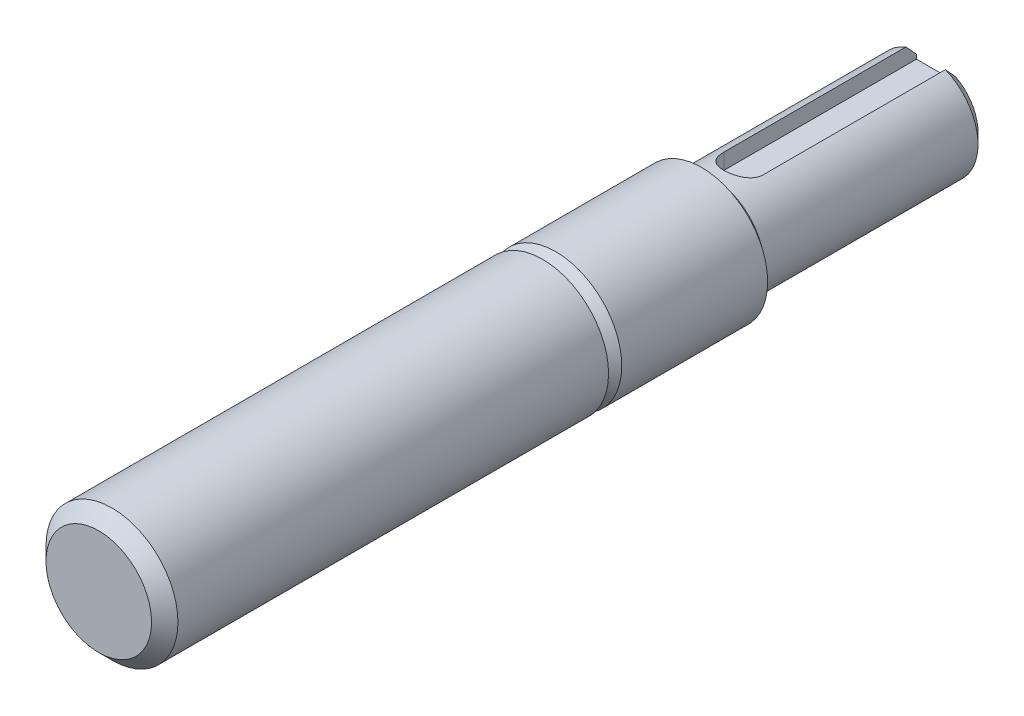
ISO-10303-21;
HEADER;
FILE_DESCRIPTION(('STEP AP214'),'2;1');
FILE_NAME('part.step','',(''),(''),'','','');
FILE_SCHEMA(('AUTOMOTIVE_DESIGN { 1 0 10303 214 1 1 1 1 }'));
ENDSEC;
DATA;
#1=APPLICATION_CONTEXT('core data for automotive mechanical design processes');
#2=APPLICATION_PROTOCOL_DEFINITION('international standard','automotive_design',2000,#1);
#3=PRODUCT_CONTEXT('',#1,'mechanical');
#4=PRODUCT('Part','Part','',(#3));
#5=PRODUCT_RELATED_PRODUCT_CATEGORY('part','',(#4));
#6=PRODUCT_DEFINITION_FORMATION('','',#4);
#7=PRODUCT_DEFINITION_CONTEXT('part definition',#1,'design');
#8=PRODUCT_DEFINITION('design','',#6,#7);
#9=PRODUCT_DEFINITION_SHAPE('','',#8);
#10=(LENGTH_UNIT() NAMED_UNIT(*) SI_UNIT(.MILLI.,.METRE.));
#11=(NAMED_UNIT(*) PLANE_ANGLE_UNIT() SI_UNIT($,.RADIAN.));
#12=(NAMED_UNIT(*) SI_UNIT($,.STERADIAN.) SOLID_ANGLE_UNIT());
#13=UNCERTAINTY_MEASURE_WITH_UNIT(LENGTH_MEASURE(1.E-05),#10,'distance_accuracy_value','');
#14=(GEOMETRIC_REPRESENTATION_CONTEXT(3) GLOBAL_UNCERTAINTY_ASSIGNED_CONTEXT((#13)) GLOBAL_UNIT_ASSIGNED_CONTEXT((#10,
#11,#12)) REPRESENTATION_CONTEXT('',''));
#15=CARTESIAN_POINT('',(0.,0.,0.));
#16=DIRECTION('',(0.,0.,1.));
#17=DIRECTION('',(1.,0.,0.));
#18=AXIS2_PLACEMENT_3D('',#15,#16,#17);
#19=CARTESIAN_POINT('',(0.,1.98120000000001,-39.1159999999999));
#20=DIRECTION('',(0.,1.00000000000001,0.));
#21=DIRECTION('',(0.,0.,1.00000000000001));
#22=AXIS2_PLACEMENT_3D('',#19,#20,#21);
#23=PLANE('',#22);
#24=CARTESIAN_POINT('',(0.,1.98120000000001,-39.1159999999999));
#25=DIRECTION('',(0.,1.00000000000001,0.));
#26=DIRECTION('',(0.,0.,1.00000000000001));
#27=AXIS2_PLACEMENT_3D('',#24,#25,#26);
#28=CIRCLE('',#27,1.19380000000001);
#29=CARTESIAN_POINT('',(-1.19380000000003,1.98120000000001,-39.1159999999999));
#30=VERTEX_POINT('',#29);
#31=CARTESIAN_POINT('',(1.19380000000002,1.98120000000001,-39.1159999999999));
#32=VERTEX_POINT('',#31);
#33=EDGE_CURVE('E82',#30,#32,#28,.T.);
#34=ORIENTED_EDGE('',*,*,#33,.T.);
#35=DIRECTION('',(0.,0.,-1.00000000000001));
#36=VECTOR('',#35,1.);
#37=CARTESIAN_POINT('',(1.19380000000002,1.98120000000001,-39.1159999999999));
#38=LINE('',#37,#36);
#39=CARTESIAN_POINT('',(1.19380000000002,1.98120000000001,-50.8));
#40=VERTEX_POINT('',#39);
#41=EDGE_CURVE('E78',#32,#40,#38,.T.);
#42=ORIENTED_EDGE('',*,*,#41,.T.);
#43=DIRECTION('',(1.00000000000001,0.,0.));
#44=VECTOR('',#43,1.);
#45=CARTESIAN_POINT('',(0.,1.98120000000001,-50.8));
#46=LINE('',#45,#44);
#47=CARTESIAN_POINT('',(-1.19380000000003,1.98120000000001,-50.8));
#48=VERTEX_POINT('',#47);
#49=EDGE_CURVE('E80',#40,#48,#46,.F.);
#50=ORIENTED_EDGE('',*,*,#49,.T.);
#51=DIRECTION('',(0.,0.,1.00000000000001));
#52=VECTOR('',#51,1.);
#53=CARTESIAN_POINT('',(-1.19380000000003,1.98120000000001,-50.8));
#54=LINE('',#53,#52);
#55=EDGE_CURVE('E105',#48,#30,#54,.T.);
#56=ORIENTED_EDGE('',*,*,#55,.T.);
#57=EDGE_LOOP('',(#34,#42,#50,#56));
#58=FACE_BOUND('',#57,.T.);
#59=ADVANCED_FACE('F24',(#58),#23,.T.);
#60=CARTESIAN_POINT('',(0.,2.54000000000001,-50.8));
#61=DIRECTION('',(0.,0.,1.00000000000001));
#62=DIRECTION('',(1.00000000000001,0.,0.));
#63=AXIS2_PLACEMENT_3D('',#60,#61,#62);
#64=PLANE('',#63);
#65=DIRECTION('',(0.,1.00000000000001,0.));
#66=VECTOR('',#65,1.);
#67=CARTESIAN_POINT('',(1.19380000000002,1.98120000000001,-50.8));
#68=LINE('',#67,#66);
#69=CARTESIAN_POINT('',(1.19380000000002,2.241972693858,-50.7999999999906));
#70=VERTEX_POINT('',#69);
#71=EDGE_CURVE('E87',#40,#70,#68,.T.);
#72=ORIENTED_EDGE('',*,*,#71,.T.);
#73=CARTESIAN_POINT('',(0.,0.,-50.7999999999811));
#74=DIRECTION('',(0.,0.,1.00000000000001));
#75=DIRECTION('',(0.,-1.00000000000001,0.));
#76=AXIS2_PLACEMENT_3D('',#73,#74,#75);
#77=CIRCLE('',#76,2.54000000001042);
#78=CARTESIAN_POINT('',(-1.19380000000003,2.24197269386216,-50.7999999999869));
#79=VERTEX_POINT('',#78);
#80=EDGE_CURVE('E72',#79,#70,#77,.T.);
#81=ORIENTED_EDGE('',*,*,#80,.F.);
#82=DIRECTION('',(0.,1.00000000000001,0.));
#83=VECTOR('',#82,1.);
#84=CARTESIAN_POINT('',(-1.19380000000003,1.98120000000001,-50.8));
#85=LINE('',#84,#83);
#86=EDGE_CURVE('E93',#79,#48,#85,.F.);
#87=ORIENTED_EDGE('',*,*,#86,.T.);
#88=ORIENTED_EDGE('',*,*,#49,.F.);
#89=EDGE_LOOP('',(#72,#81,#87,#88));
#90=FACE_BOUND('',#89,.T.);
#91=ADVANCED_FACE('F90',(#90),#64,.F.);
#92=CARTESIAN_POINT('',(1.19380000000002,1.98120000000001,-39.1159999999999));
#93=DIRECTION('',(1.00000000000001,0.,0.));
#94=DIRECTION('',(0.,0.,-1.00000000000001));
#95=AXIS2_PLACEMENT_3D('',#92,#93,#94);
#96=PLANE('',#95);
#97=ORIENTED_EDGE('',*,*,#71,.F.);
#98=ORIENTED_EDGE('',*,*,#41,.F.);
#99=DIRECTION('',(0.,1.00000000000001,0.));
#100=VECTOR('',#99,1.);
#101=CARTESIAN_POINT('',(1.19380000000002,1.98120000000001,-39.1159999999999));
#102=LINE('',#101,#100);
#103=CARTESIAN_POINT('',(1.19380000000001,2.9420174302679,-39.1159999999999));
#104=VERTEX_POINT('',#103);
#105=EDGE_CURVE('E99',#32,#104,#102,.T.);
#106=ORIENTED_EDGE('',*,*,#105,.T.);
#107=DIRECTION('',(0.,0.,1.00000000000001));
#108=VECTOR('',#107,1.);
#109=CARTESIAN_POINT('',(1.1938,2.94201743026791,0.));
#110=LINE('',#109,#108);
#111=CARTESIAN_POINT('',(1.19380000000001,2.9420174302658,-50.1649999999978));
#112=VERTEX_POINT('',#111);
#113=EDGE_CURVE('E138',#112,#104,#110,.T.);
#114=ORIENTED_EDGE('',*,*,#113,.F.);
#115=CARTESIAN_POINT('',(1.19380000000002,2.2419726938556,-50.7999999999926));
#116=CARTESIAN_POINT('',(1.19380000000002,2.30102184773773,-50.7478727474391));
#117=CARTESIAN_POINT('',(1.19380000000002,2.35985132104961,-50.69549787316));
#118=CARTESIAN_POINT('',(1.19380000000002,2.47713422347976,-50.5903327827947));
#119=CARTESIAN_POINT('',(1.19380000000002,2.53558766595212,-50.5375425816077));
#120=CARTESIAN_POINT('',(1.19380000000002,2.65218538347848,-50.4316235937607));
#121=CARTESIAN_POINT('',(1.19380000000002,2.71032966196328,-50.3784948108723));
#122=CARTESIAN_POINT('',(1.19380000000002,2.82635784116009,-50.2719494622468));
#123=CARTESIAN_POINT('',(1.19380000000002,2.88424173252969,-50.2185328863327));
#124=CARTESIAN_POINT('',(1.19380000000002,2.94201743026369,-50.1649999999954));
#125=B_SPLINE_CURVE_WITH_KNOTS('',3,(#115,#116,#117,#118,#119,#120,#121,#122,#123,#124),
.UNSPECIFIED.,.F.,.F.,(4,2,2,2,4),(0.,0.236295571088815,0.472582703695575,0.708867208729286,
0.94516012485222),.UNSPECIFIED.);
#126=EDGE_CURVE('E27',#70,#112,#125,.T.);
#127=ORIENTED_EDGE('',*,*,#126,.F.);
#128=EDGE_LOOP('',(#97,#98,#106,#114,#127));
#129=FACE_BOUND('',#128,.T.);
#130=ADVANCED_FACE('F96',(#129),#96,.F.);
#131=CARTESIAN_POINT('',(0.,1.98120000000001,-39.1159999999999));
#132=DIRECTION('',(0.,1.00000000000001,0.));
#133=DIRECTION('',(0.,0.,1.00000000000001));
#134=AXIS2_PLACEMENT_3D('',#131,#132,#133);
#135=CYLINDRICAL_SURFACE('',#134,1.19380000000001);
#136=ORIENTED_EDGE('',*,*,#33,.F.);
#137=DIRECTION('',(0.,1.00000000000001,0.));
#138=VECTOR('',#137,1.);
#139=CARTESIAN_POINT('',(-1.19380000000003,1.98120000000001,-39.1159999999999));
#140=LINE('',#139,#138);
#141=CARTESIAN_POINT('',(-1.19380000000003,2.9420174302679,-39.1159999999999));
#142=VERTEX_POINT('',#141);
#143=EDGE_CURVE('E47',#30,#142,#140,.T.);
#144=ORIENTED_EDGE('',*,*,#143,.T.);
#145=CARTESIAN_POINT('',(1.19380000000002,2.9420174302679,-39.1159999999999));
#146=CARTESIAN_POINT('',(1.19380119866681,2.94201358886018,-39.0837006794339));
#147=CARTESIAN_POINT('',(1.19248832274411,2.94255000472484,-39.0514181860547));
#148=CARTESIAN_POINT('',(1.18726004777156,2.94466476095056,-38.9871097153263));
#149=CARTESIAN_POINT('',(1.18334552701423,2.9462427496845,-38.955083655099));
#150=CARTESIAN_POINT('',(1.16778270495956,2.95246335059753,-38.8599733658816));
#151=CARTESIAN_POINT('',(1.15231460697321,2.95859328345994,-38.7975669873184));
#152=CARTESIAN_POINT('',(1.11178752058579,2.9740571839648,-38.6764915213747));
#153=CARTESIAN_POINT('',(1.08673654710451,2.98338847338761,-38.6178193584763));
#154=CARTESIAN_POINT('',(1.02781996154746,3.00419457553497,-38.50544959503));
#155=CARTESIAN_POINT('',(0.993947310826072,3.01567109782598,-38.4517560133961));
#156=CARTESIAN_POINT('',(0.916556207241795,3.04010954434603,-38.3482459870198));
#157=CARTESIAN_POINT('',(0.872671556205444,3.05311512160911,-38.2987137068106));
#158=CARTESIAN_POINT('',(0.77726876797622,3.07878482333537,-38.2075022142624));
#159=CARTESIAN_POINT('',(0.725747937264904,3.09144882544372,-38.1658257847588));
#160=CARTESIAN_POINT('',(0.614351502605501,3.11553409970197,-38.0901245060353));
#161=CARTESIAN_POINT('',(0.554248365904604,3.12689715223568,-38.0564145947421));
#162=CARTESIAN_POINT('',(0.428755311996347,3.14655515237974,-37.9997321113863));
#163=CARTESIAN_POINT('',(0.363372090039058,3.15485391337645,-37.9767461843049));
#164=CARTESIAN_POINT('',(0.248113919559836,3.16566292006338,-37.9472046793582));
#165=CARTESIAN_POINT('',(0.199029981495512,3.1691437195283,-37.9378494767225));
#166=CARTESIAN_POINT('',(0.0999697368556592,3.17381293873971,-37.9253464096885));
#167=CARTESIAN_POINT('',(0.0499935098316348,3.17500156182402,-37.9221979946887));
#168=CARTESIAN_POINT('',(-0.0645836126415552,3.17499798237341,-37.9222025905411));
#169=CARTESIAN_POINT('',(-0.129196067703964,3.17300972415623,-37.9274627613587));
#170=CARTESIAN_POINT('',(-0.256527554722546,3.16526427616921,-37.9483006085164));
#171=CARTESIAN_POINT('',(-0.319245052887496,3.15950411459597,-37.9638864203257));
#172=CARTESIAN_POINT('',(-0.440872116174826,3.14483739738045,-38.0047409480994));
#173=CARTESIAN_POINT('',(-0.49979020110219,3.13593819310398,-38.0299870521122));
#174=CARTESIAN_POINT('',(-0.612540299690514,3.11587921133502,-38.0893476602134));
#175=CARTESIAN_POINT('',(-0.666371662363203,3.10471914507508,-38.1234632973163));
#176=CARTESIAN_POINT('',(-0.769730700845361,3.08075692073996,-38.2011170498579));
#177=CARTESIAN_POINT('',(-0.819012913251011,3.06790808599839,-38.2449673466599));
#178=CARTESIAN_POINT('',(-0.909725244508935,3.04224448099812,-38.3401877476378));
#179=CARTESIAN_POINT('',(-0.951152407159744,3.0294297253467,-38.3915606700695));
#180=CARTESIAN_POINT('',(-1.02655136130083,3.00473884965425,-38.5027816716129));
#181=CARTESIAN_POINT('',(-1.06017236896751,2.99291828643935,-38.5628808896545));
#182=CARTESIAN_POINT('',(-1.11669659174172,2.97229264990148,-38.6883666895999));
#183=CARTESIAN_POINT('',(-1.13961269630881,2.96348395352319,-38.7537468010456));
#184=CARTESIAN_POINT('',(-1.16897915366354,2.95199794769411,-38.8688091509099));
#185=CARTESIAN_POINT('',(-1.17825632196959,2.94829017043031,-38.9176833288506));
#186=CARTESIAN_POINT('',(-1.19067896582104,2.94328394485072,-39.0163579822044));
#187=CARTESIAN_POINT('',(-1.193820132702,2.94198718957128,-39.0661590837432));
#188=CARTESIAN_POINT('',(-1.19380000000002,2.9420174302679,-39.1159999999999));
#189=B_SPLINE_CURVE_WITH_KNOTS('',3,(#145,#146,#147,#148,#149,#150,#151,#152,#153,#154,#155,
#156,#157,#158,#159,#160,#161,#162,#163,#164,#165,#166,#167,#168,#169,#170,#171,#172,#173,#174,
#175,#176,#177,#178,#179,#180,#181,#182,#183,#184,#185,#186,#187,#188),.UNSPECIFIED.,.F.,.F.,(4,
2,2,2,2,2,2,2,2,2,2,2,2,2,2,2,2,2,2,2,2,4),(0.,0.0968341725825814,0.19363567138997,
0.38638032511346,0.57896412240181,0.77170205185567,0.973134503540011,1.17463817656639,
1.38311961181788,1.59134071893424,1.74118814916198,1.89102228588725,2.08458400778526,
2.27829841668477,2.47156214275156,2.66485056890994,2.86558014013228,3.06638510544826,
3.27496528909716,3.48329367597683,3.63252530028038,3.78186167654538),.UNSPECIFIED.);
#190=EDGE_CURVE('E129',#104,#142,#189,.T.);
#191=ORIENTED_EDGE('',*,*,#190,.F.);
#192=ORIENTED_EDGE('',*,*,#105,.F.);
#193=EDGE_LOOP('',(#136,#144,#191,#192));
#194=FACE_BOUND('',#193,.T.);
#195=ADVANCED_FACE('F140',(#194),#135,.F.);
#196=CARTESIAN_POINT('',(-1.19380000000003,1.98120000000001,-50.8));
#197=DIRECTION('',(-1.00000000000001,0.,0.));
#198=DIRECTION('',(0.,0.,1.00000000000001));
#199=AXIS2_PLACEMENT_3D('',#196,#197,#198);
#200=PLANE('',#199);
#201=ORIENTED_EDGE('',*,*,#55,.F.);
#202=ORIENTED_EDGE('',*,*,#86,.F.);
#203=CARTESIAN_POINT('',(-1.19380000000003,2.94201743026369,-50.1649999999954));
#204=CARTESIAN_POINT('',(-1.19380000000003,2.88424173252969,-50.2185328863327));
#205=CARTESIAN_POINT('',(-1.19380000000003,2.82635784116009,-50.2719494622468));
#206=CARTESIAN_POINT('',(-1.19380000000003,2.71032966196328,-50.3784948108723));
#207=CARTESIAN_POINT('',(-1.19380000000003,2.65218538347849,-50.4316235937607));
#208=CARTESIAN_POINT('',(-1.19380000000003,2.53558766595213,-50.5375425816077));
#209=CARTESIAN_POINT('',(-1.19380000000003,2.47713422347976,-50.5903327827946));
#210=CARTESIAN_POINT('',(-1.19380000000003,2.35985132104962,-50.69549787316));
#211=CARTESIAN_POINT('',(-1.19380000000003,2.30102184773774,-50.7478727474391));
#212=CARTESIAN_POINT('',(-1.19380000000003,2.24197269385563,-50.7999999999926));
#213=B_SPLINE_CURVE_WITH_KNOTS('',3,(#203,#204,#205,#206,#207,#208,#209,#210,#211,#212),
.UNSPECIFIED.,.F.,.F.,(4,2,2,2,4),(0.,0.236292916122929,0.472577421156638,0.708864553763398,
0.945160124852205),.UNSPECIFIED.);
#214=CARTESIAN_POINT('',(-1.19380000000003,2.9420174302658,-50.1649999999978));
#215=VERTEX_POINT('',#214);
#216=EDGE_CURVE('E156',#215,#79,#213,.T.);
#217=ORIENTED_EDGE('',*,*,#216,.F.);
#218=DIRECTION('',(0.,0.,1.00000000000001));
#219=VECTOR('',#218,1.);
#220=CARTESIAN_POINT('',(-1.19380000000003,2.9420174302679,0.));
#221=LINE('',#220,#219);
#222=EDGE_CURVE('E137',#142,#215,#221,.F.);
#223=ORIENTED_EDGE('',*,*,#222,.F.);
#224=ORIENTED_EDGE('',*,*,#143,.F.);
#225=EDGE_LOOP('',(#201,#202,#217,#223,#224));
#226=FACE_BOUND('',#225,.T.);
#227=ADVANCED_FACE('F153',(#226),#200,.F.);
#228=CARTESIAN_POINT('',(0.,0.,-50.1649999999927));
#229=DIRECTION('',(0.,0.,1.00000000000001));
#230=DIRECTION('',(0.,-1.00000000000001,0.));
#231=AXIS2_PLACEMENT_3D('',#228,#229,#230);
#232=CONICAL_SURFACE('',#231,3.17499999999882,0.785398163397448);
#233=ORIENTED_EDGE('',*,*,#80,.T.);
#234=ORIENTED_EDGE('',*,*,#126,.T.);
#235=CARTESIAN_POINT('',(0.,0.,-50.165));
#236=DIRECTION('',(0.,0.,1.00000000000001));
#237=DIRECTION('',(1.00000000000001,0.,0.));
#238=AXIS2_PLACEMENT_3D('',#235,#236,#237);
#239=CIRCLE('',#238,3.175);
#240=EDGE_CURVE('E163',#215,#112,#239,.T.);
#241=ORIENTED_EDGE('',*,*,#240,.F.);
#242=ORIENTED_EDGE('',*,*,#216,.T.);
#243=EDGE_LOOP('',(#233,#234,#241,#242));
#244=FACE_BOUND('',#243,.T.);
#245=ADVANCED_FACE('F148',(#244),#232,.T.);
#246=CARTESIAN_POINT('',(0.,0.,0.));
#247=DIRECTION('',(0.,0.,1.00000000000001));
#248=DIRECTION('',(1.00000000000001,0.,0.));
#249=AXIS2_PLACEMENT_3D('',#246,#247,#248);
#250=CYLINDRICAL_SURFACE('',#249,3.175);
#251=ORIENTED_EDGE('',*,*,#222,.T.);
#252=ORIENTED_EDGE('',*,*,#240,.T.);
#253=ORIENTED_EDGE('',*,*,#113,.T.);
#254=ORIENTED_EDGE('',*,*,#190,.T.);
#255=EDGE_LOOP('',(#251,#252,#253,#254));
#256=FACE_BOUND('',#255,.T.);
#257=CARTESIAN_POINT('',(0.,0.,-37.2109999999566));
#258=DIRECTION('',(0.,0.,-1.00000000000001));
#259=DIRECTION('',(-1.00000000000001,0.,0.));
#260=AXIS2_PLACEMENT_3D('',#257,#258,#259);
#261=CIRCLE('',#260,3.1749999999704);
#262=CARTESIAN_POINT('',(-3.17499999997044,0.,-37.2109999999566));
#263=VERTEX_POINT('',#262);
#264=EDGE_CURVE('E128',#263,#263,#261,.F.);
#265=ORIENTED_EDGE('',*,*,#264,.F.);
#266=EDGE_LOOP('',(#265));
#267=FACE_BOUND('',#266,.T.);
#268=ADVANCED_FACE('F143',(#256,#267),#250,.T.);
#269=CARTESIAN_POINT('',(0.,0.,-37.2109999999566));
#270=DIRECTION('',(0.,0.,-1.00000000000001));
#271=DIRECTION('',(-1.00000000000001,0.,0.));
#272=AXIS2_PLACEMENT_3D('',#269,#270,#271);
#273=CONICAL_SURFACE('',#272,3.1749999999704,0.463647609000806);
#274=CARTESIAN_POINT('',(0.,0.,-36.5759999999682));
#275=DIRECTION('',(0.,0.,-1.00000000000001));
#276=DIRECTION('',(-1.00000000000001,0.,0.));
#277=AXIS2_PLACEMENT_3D('',#274,#275,#276);
#278=CIRCLE('',#277,2.8574999999762);
#279=CARTESIAN_POINT('',(-2.85749999997624,0.,-36.5759999999682));
#280=VERTEX_POINT('',#279);
#281=EDGE_CURVE('E125',#280,#280,#278,.T.);
#282=ORIENTED_EDGE('',*,*,#281,.T.);
#283=EDGE_LOOP('',(#282));
#284=FACE_BOUND('',#283,.T.);
#285=ORIENTED_EDGE('',*,*,#264,.T.);
#286=EDGE_LOOP('',(#285));
#287=FACE_BOUND('',#286,.T.);
#288=ADVANCED_FACE('F147',(#284,#287),#273,.T.);
#289=CARTESIAN_POINT('',(0.,4.00177000000003,-36.5759999999999));
#290=DIRECTION('',(0.,0.,1.00000000000001));
#291=DIRECTION('',(1.00000000000001,0.,0.));
#292=AXIS2_PLACEMENT_3D('',#289,#290,#291);
#293=PLANE('',#292);
#294=ORIENTED_EDGE('',*,*,#281,.F.);
#295=EDGE_LOOP('',(#294));
#296=FACE_BOUND('',#295,.T.);
#297=CARTESIAN_POINT('',(0.,0.,-36.5759999999999));
#298=DIRECTION('',(0.,0.,1.00000000000001));
#299=DIRECTION('',(1.00000000000001,0.,0.));
#300=AXIS2_PLACEMENT_3D('',#297,#298,#299);
#301=CIRCLE('',#300,4.00177);
#302=CARTESIAN_POINT('',(4.00177000000005,0.,-36.5759999999999));
#303=VERTEX_POINT('',#302);
#304=EDGE_CURVE('E122',#303,#303,#301,.T.);
#305=ORIENTED_EDGE('',*,*,#304,.F.);
#306=EDGE_LOOP('',(#305));
#307=FACE_BOUND('',#306,.T.);
#308=ADVANCED_FACE('F210',(#296,#307),#293,.F.);
#309=CARTESIAN_POINT('',(0.,0.,0.));
#310=DIRECTION('',(0.,0.,1.00000000000001));
#311=DIRECTION('',(1.00000000000001,0.,0.));
#312=AXIS2_PLACEMENT_3D('',#309,#310,#311);
#313=CYLINDRICAL_SURFACE('',#312,4.00177);
#314=ORIENTED_EDGE('',*,*,#304,.T.);
#315=EDGE_LOOP('',(#314));
#316=FACE_BOUND('',#315,.T.);
#317=CARTESIAN_POINT('',(0.,0.,-27.7243539999859));
#318=DIRECTION('',(0.,0.,-1.00000000000001));
#319=DIRECTION('',(-1.00000000000001,0.,0.));
#320=AXIS2_PLACEMENT_3D('',#317,#318,#319);
#321=CIRCLE('',#320,4.00176999994528);
#322=CARTESIAN_POINT('',(-4.00176999994533,0.,-27.7243539999859));
#323=VERTEX_POINT('',#322);
#324=EDGE_CURVE('E121',#323,#323,#321,.F.);
#325=ORIENTED_EDGE('',*,*,#324,.F.);
#326=EDGE_LOOP('',(#325));
#327=FACE_BOUND('',#326,.T.);
#328=ADVANCED_FACE('F207',(#316,#327),#313,.T.);
#329=CARTESIAN_POINT('',(0.,0.,-27.7243539999859));
#330=DIRECTION('',(0.,0.,-1.00000000000001));
#331=DIRECTION('',(0.,1.00000000000001,0.));
#332=AXIS2_PLACEMENT_3D('',#329,#330,#331);
#333=CONICAL_SURFACE('',#332,4.00176999994528,0.785398163397448);
#334=CARTESIAN_POINT('',(0.,0.,-26.9240000000082));
#335=DIRECTION('',(0.,0.,-1.00000000000001));
#336=DIRECTION('',(0.,1.00000000000001,0.));
#337=AXIS2_PLACEMENT_3D('',#334,#335,#336);
#338=CIRCLE('',#337,3.20141599996759);
#339=CARTESIAN_POINT('',(0.,3.20141599996761,-26.9240000000082));
#340=VERTEX_POINT('',#339);
#341=EDGE_CURVE('E118',#340,#340,#338,.T.);
#342=ORIENTED_EDGE('',*,*,#341,.T.);
#343=EDGE_LOOP('',(#342));
#344=FACE_BOUND('',#343,.T.);
#345=ORIENTED_EDGE('',*,*,#324,.T.);
#346=EDGE_LOOP('',(#345));
#347=FACE_BOUND('',#346,.T.);
#348=ADVANCED_FACE('F203',(#344,#347),#333,.T.);
#349=CARTESIAN_POINT('',(0.,0.,0.));
#350=DIRECTION('',(0.,0.,-1.00000000000001));
#351=DIRECTION('',(-1.00000000000001,0.,0.));
#352=AXIS2_PLACEMENT_3D('',#349,#350,#351);
#353=PLANE('',#352);
#354=CARTESIAN_POINT('',(0.,0.,0.));
#355=DIRECTION('',(0.,0.,-1.00000000000001));
#356=DIRECTION('',(-1.00000000000001,0.,0.));
#357=AXIS2_PLACEMENT_3D('',#354,#355,#356);
#358=CIRCLE('',#357,3.20141599996759);
#359=CARTESIAN_POINT('',(-3.20141599996764,0.,0.));
#360=VERTEX_POINT('',#359);
#361=EDGE_CURVE('E115',#360,#360,#358,.T.);
#362=ORIENTED_EDGE('',*,*,#361,.F.);
#363=EDGE_LOOP('',(#362));
#364=FACE_BOUND('',#363,.T.);
#365=ADVANCED_FACE('F199',(#364),#353,.F.);
#366=CARTESIAN_POINT('',(0.,4.00177000000003,-26.9239999999999));
#367=DIRECTION('',(0.,0.,1.00000000000001));
#368=DIRECTION('',(1.00000000000001,0.,0.));
#369=AXIS2_PLACEMENT_3D('',#366,#367,#368);
#370=PLANE('',#369);
#371=ORIENTED_EDGE('',*,*,#341,.F.);
#372=EDGE_LOOP('',(#371));
#373=FACE_BOUND('',#372,.T.);
#374=CARTESIAN_POINT('',(0.,0.,-26.9239999999999));
#375=DIRECTION('',(0.,0.,1.00000000000001));
#376=DIRECTION('',(1.00000000000001,0.,0.));
#377=AXIS2_PLACEMENT_3D('',#374,#375,#376);
#378=CIRCLE('',#377,4.00177);
#379=CARTESIAN_POINT('',(4.00177000000005,0.,-26.9239999999999));
#380=VERTEX_POINT('',#379);
#381=EDGE_CURVE('E38',#380,#380,#378,.T.);
#382=ORIENTED_EDGE('',*,*,#381,.F.);
#383=EDGE_LOOP('',(#382));
#384=FACE_BOUND('',#383,.T.);
#385=ADVANCED_FACE('F192',(#373,#384),#370,.F.);
#386=CARTESIAN_POINT('',(0.,0.,-0.800354000034531));
#387=DIRECTION('',(0.,0.,-1.00000000000001));
#388=DIRECTION('',(-1.00000000000001,0.,0.));
#389=AXIS2_PLACEMENT_3D('',#386,#387,#388);
#390=CONICAL_SURFACE('',#389,4.00177000000213,0.785398163397448);
#391=CARTESIAN_POINT('',(0.,0.,-0.800353999999892));
#392=DIRECTION('',(0.,0.,1.00000000000001));
#393=DIRECTION('',(1.00000000000001,0.,0.));
#394=AXIS2_PLACEMENT_3D('',#391,#392,#393);
#395=CIRCLE('',#394,4.00177);
#396=CARTESIAN_POINT('',(4.00177000000005,0.,-0.800353999999892));
#397=VERTEX_POINT('',#396);
#398=EDGE_CURVE('E13',#397,#397,#395,.F.);
#399=ORIENTED_EDGE('',*,*,#398,.F.);
#400=EDGE_LOOP('',(#399));
#401=FACE_BOUND('',#400,.T.);
#402=ORIENTED_EDGE('',*,*,#361,.T.);
#403=EDGE_LOOP('',(#402));
#404=FACE_BOUND('',#403,.T.);
#405=ADVANCED_FACE('F185',(#401,#404),#390,.T.);
#406=CARTESIAN_POINT('',(0.,0.,0.));
#407=DIRECTION('',(0.,0.,1.00000000000001));
#408=DIRECTION('',(1.00000000000001,0.,0.));
#409=AXIS2_PLACEMENT_3D('',#406,#407,#408);
#410=CYLINDRICAL_SURFACE('',#409,4.00177);
#411=ORIENTED_EDGE('',*,*,#398,.T.);
#412=EDGE_LOOP('',(#411));
#413=FACE_BOUND('',#412,.T.);
#414=ORIENTED_EDGE('',*,*,#381,.T.);
#415=EDGE_LOOP('',(#414));
#416=FACE_BOUND('',#415,.T.);
#417=ADVANCED_FACE('F183',(#413,#416),#410,.T.);
#418=CLOSED_SHELL('',(#59,#91,#130,#195,#227,#245,#268,#288,#308,#328,#348,#365,#385,#405,#417));
#419=MANIFOLD_SOLID_BREP('B1',#418);
#420=ADVANCED_BREP_SHAPE_REPRESENTATION('',(#18,#419),#14);
#421=SHAPE_DEFINITION_REPRESENTATION(#9,#420);
ENDSEC;
END-ISO-10303-21;
